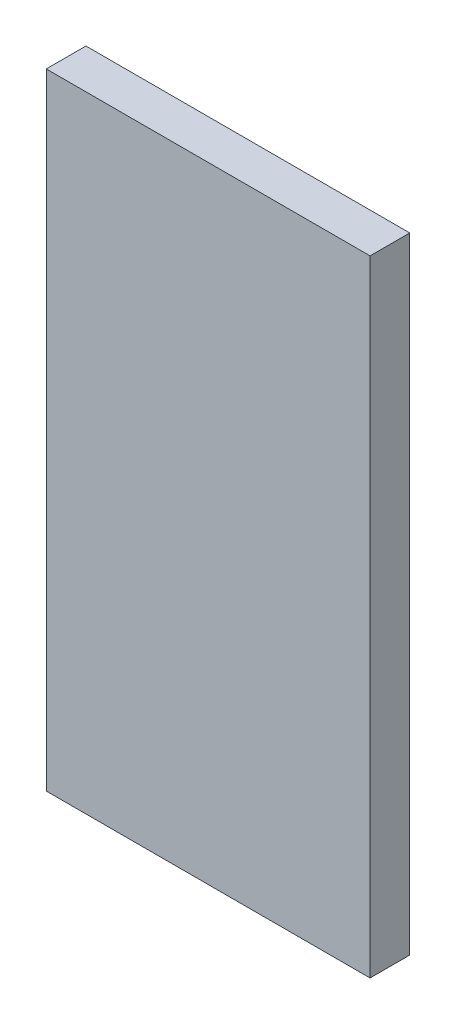
ISO-10303-21;
HEADER;
FILE_DESCRIPTION(('STEP AP214'),'2;1');
FILE_NAME('part.step','',(''),(''),'','','');
FILE_SCHEMA(('AUTOMOTIVE_DESIGN { 1 0 10303 214 1 1 1 1 }'));
ENDSEC;
DATA;
#1=APPLICATION_CONTEXT('core data for automotive mechanical design processes');
#2=APPLICATION_PROTOCOL_DEFINITION('international standard','automotive_design',2000,#1);
#3=PRODUCT_CONTEXT('',#1,'mechanical');
#4=PRODUCT('Part','Part','',(#3));
#5=PRODUCT_RELATED_PRODUCT_CATEGORY('part','',(#4));
#6=PRODUCT_DEFINITION_FORMATION('','',#4);
#7=PRODUCT_DEFINITION_CONTEXT('part definition',#1,'design');
#8=PRODUCT_DEFINITION('design','',#6,#7);
#9=PRODUCT_DEFINITION_SHAPE('','',#8);
#10=(LENGTH_UNIT() NAMED_UNIT(*) SI_UNIT(.MILLI.,.METRE.));
#11=(NAMED_UNIT(*) PLANE_ANGLE_UNIT() SI_UNIT($,.RADIAN.));
#12=(NAMED_UNIT(*) SI_UNIT($,.STERADIAN.) SOLID_ANGLE_UNIT());
#13=UNCERTAINTY_MEASURE_WITH_UNIT(LENGTH_MEASURE(1.E-05),#10,'distance_accuracy_value','');
#14=(GEOMETRIC_REPRESENTATION_CONTEXT(3) GLOBAL_UNCERTAINTY_ASSIGNED_CONTEXT((#13)) GLOBAL_UNIT_ASSIGNED_CONTEXT((#10,
#11,#12)) REPRESENTATION_CONTEXT('',''));
#15=CARTESIAN_POINT('',(0.,0.,0.));
#16=DIRECTION('',(0.,0.,1.));
#17=DIRECTION('',(1.,0.,0.));
#18=AXIS2_PLACEMENT_3D('',#15,#16,#17);
#19=CARTESIAN_POINT('',(4.672,2.122,0.1));
#20=DIRECTION('',(0.,0.,1.));
#21=DIRECTION('',(1.,0.,0.));
#22=AXIS2_PLACEMENT_3D('',#19,#20,#21);
#23=PLANE('',#22);
#24=DIRECTION('',(0.,1.,0.));
#25=VECTOR('',#24,1.);
#26=CARTESIAN_POINT('',(5.488,2.122,0.1));
#27=LINE('',#26,#25);
#28=CARTESIAN_POINT('',(5.488,3.698,0.1));
#29=VERTEX_POINT('',#28);
#30=CARTESIAN_POINT('',(5.488,2.122,0.1));
#31=VERTEX_POINT('',#30);
#32=EDGE_CURVE('E75',#29,#31,#27,.F.);
#33=ORIENTED_EDGE('',*,*,#32,.F.);
#34=DIRECTION('',(1.,0.,0.));
#35=VECTOR('',#34,1.);
#36=CARTESIAN_POINT('',(4.672,3.698,0.1));
#37=LINE('',#36,#35);
#38=CARTESIAN_POINT('',(4.672,3.698,0.1));
#39=VERTEX_POINT('',#38);
#40=EDGE_CURVE('E57',#39,#29,#37,.T.);
#41=ORIENTED_EDGE('',*,*,#40,.F.);
#42=DIRECTION('',(0.,1.,0.));
#43=VECTOR('',#42,1.);
#44=CARTESIAN_POINT('',(4.672,2.122,0.1));
#45=LINE('',#44,#43);
#46=CARTESIAN_POINT('',(4.672,2.122,0.1));
#47=VERTEX_POINT('',#46);
#48=EDGE_CURVE('E19',#39,#47,#45,.F.);
#49=ORIENTED_EDGE('',*,*,#48,.T.);
#50=DIRECTION('',(1.,0.,0.));
#51=VECTOR('',#50,1.);
#52=CARTESIAN_POINT('',(4.672,2.122,0.1));
#53=LINE('',#52,#51);
#54=EDGE_CURVE('E54',#47,#31,#53,.T.);
#55=ORIENTED_EDGE('',*,*,#54,.T.);
#56=EDGE_LOOP('',(#33,#41,#49,#55));
#57=FACE_BOUND('',#56,.T.);
#58=ADVANCED_FACE('F16',(#57),#23,.T.);
#59=CARTESIAN_POINT('',(4.672,2.122,0.));
#60=DIRECTION('',(1.,0.,0.));
#61=DIRECTION('',(0.,0.,-1.));
#62=AXIS2_PLACEMENT_3D('',#59,#60,#61);
#63=PLANE('',#62);
#64=DIRECTION('',(0.,0.,1.));
#65=VECTOR('',#64,1.);
#66=CARTESIAN_POINT('',(4.672,3.698,0.));
#67=LINE('',#66,#65);
#68=CARTESIAN_POINT('',(4.672,3.698,0.));
#69=VERTEX_POINT('',#68);
#70=EDGE_CURVE('E77',#69,#39,#67,.T.);
#71=ORIENTED_EDGE('',*,*,#70,.F.);
#72=DIRECTION('',(0.,1.,0.));
#73=VECTOR('',#72,1.);
#74=CARTESIAN_POINT('',(4.672,2.122,0.));
#75=LINE('',#74,#73);
#76=CARTESIAN_POINT('',(4.672,2.122,0.));
#77=VERTEX_POINT('',#76);
#78=EDGE_CURVE('E72',#69,#77,#75,.F.);
#79=ORIENTED_EDGE('',*,*,#78,.T.);
#80=DIRECTION('',(0.,0.,1.));
#81=VECTOR('',#80,1.);
#82=CARTESIAN_POINT('',(4.672,2.122,0.));
#83=LINE('',#82,#81);
#84=EDGE_CURVE('E62',#77,#47,#83,.T.);
#85=ORIENTED_EDGE('',*,*,#84,.T.);
#86=ORIENTED_EDGE('',*,*,#48,.F.);
#87=EDGE_LOOP('',(#71,#79,#85,#86));
#88=FACE_BOUND('',#87,.T.);
#89=ADVANCED_FACE('F71',(#88),#63,.F.);
#90=CARTESIAN_POINT('',(4.672,2.122,0.));
#91=DIRECTION('',(0.,1.,0.));
#92=DIRECTION('',(0.,0.,1.));
#93=AXIS2_PLACEMENT_3D('',#90,#91,#92);
#94=PLANE('',#93);
#95=ORIENTED_EDGE('',*,*,#54,.F.);
#96=ORIENTED_EDGE('',*,*,#84,.F.);
#97=DIRECTION('',(1.,0.,0.));
#98=VECTOR('',#97,1.);
#99=CARTESIAN_POINT('',(4.672,2.122,0.));
#100=LINE('',#99,#98);
#101=CARTESIAN_POINT('',(5.488,2.122,0.));
#102=VERTEX_POINT('',#101);
#103=EDGE_CURVE('E82',#77,#102,#100,.T.);
#104=ORIENTED_EDGE('',*,*,#103,.T.);
#105=DIRECTION('',(0.,0.,-1.));
#106=VECTOR('',#105,1.);
#107=CARTESIAN_POINT('',(5.488,2.122,0.));
#108=LINE('',#107,#106);
#109=EDGE_CURVE('E68',#31,#102,#108,.T.);
#110=ORIENTED_EDGE('',*,*,#109,.F.);
#111=EDGE_LOOP('',(#95,#96,#104,#110));
#112=FACE_BOUND('',#111,.T.);
#113=ADVANCED_FACE('F65',(#112),#94,.F.);
#114=CARTESIAN_POINT('',(5.488,2.122,0.));
#115=DIRECTION('',(1.,0.,0.));
#116=DIRECTION('',(0.,0.,-1.));
#117=AXIS2_PLACEMENT_3D('',#114,#115,#116);
#118=PLANE('',#117);
#119=DIRECTION('',(0.,0.,1.));
#120=VECTOR('',#119,1.);
#121=CARTESIAN_POINT('',(5.488,3.698,0.));
#122=LINE('',#121,#120);
#123=CARTESIAN_POINT('',(5.488,3.698,0.));
#124=VERTEX_POINT('',#123);
#125=EDGE_CURVE('E33',#29,#124,#122,.F.);
#126=ORIENTED_EDGE('',*,*,#125,.F.);
#127=ORIENTED_EDGE('',*,*,#32,.T.);
#128=ORIENTED_EDGE('',*,*,#109,.T.);
#129=DIRECTION('',(0.,1.,0.));
#130=VECTOR('',#129,1.);
#131=CARTESIAN_POINT('',(5.488,2.122,0.));
#132=LINE('',#131,#130);
#133=EDGE_CURVE('E25',#102,#124,#132,.T.);
#134=ORIENTED_EDGE('',*,*,#133,.T.);
#135=EDGE_LOOP('',(#126,#127,#128,#134));
#136=FACE_BOUND('',#135,.T.);
#137=ADVANCED_FACE('F87',(#136),#118,.T.);
#138=CARTESIAN_POINT('',(4.672,3.698,0.));
#139=DIRECTION('',(0.,1.,0.));
#140=DIRECTION('',(0.,0.,1.));
#141=AXIS2_PLACEMENT_3D('',#138,#139,#140);
#142=PLANE('',#141);
#143=ORIENTED_EDGE('',*,*,#40,.T.);
#144=ORIENTED_EDGE('',*,*,#125,.T.);
#145=DIRECTION('',(1.,0.,0.));
#146=VECTOR('',#145,1.);
#147=CARTESIAN_POINT('',(4.672,3.698,0.));
#148=LINE('',#147,#146);
#149=EDGE_CURVE('E11',#124,#69,#148,.F.);
#150=ORIENTED_EDGE('',*,*,#149,.T.);
#151=ORIENTED_EDGE('',*,*,#70,.T.);
#152=EDGE_LOOP('',(#143,#144,#150,#151));
#153=FACE_BOUND('',#152,.T.);
#154=ADVANCED_FACE('F90',(#153),#142,.T.);
#155=CARTESIAN_POINT('',(4.672,2.122,0.));
#156=DIRECTION('',(0.,0.,1.));
#157=DIRECTION('',(1.,0.,0.));
#158=AXIS2_PLACEMENT_3D('',#155,#156,#157);
#159=PLANE('',#158);
#160=ORIENTED_EDGE('',*,*,#133,.F.);
#161=ORIENTED_EDGE('',*,*,#103,.F.);
#162=ORIENTED_EDGE('',*,*,#78,.F.);
#163=ORIENTED_EDGE('',*,*,#149,.F.);
#164=EDGE_LOOP('',(#160,#161,#162,#163));
#165=FACE_BOUND('',#164,.T.);
#166=ADVANCED_FACE('F89',(#165),#159,.F.);
#167=CLOSED_SHELL('',(#58,#89,#113,#137,#154,#166));
#168=MANIFOLD_SOLID_BREP('B1',#167);
#169=ADVANCED_BREP_SHAPE_REPRESENTATION('',(#18,#168),#14);
#170=SHAPE_DEFINITION_REPRESENTATION(#9,#169);
ENDSEC;
END-ISO-10303-21;
